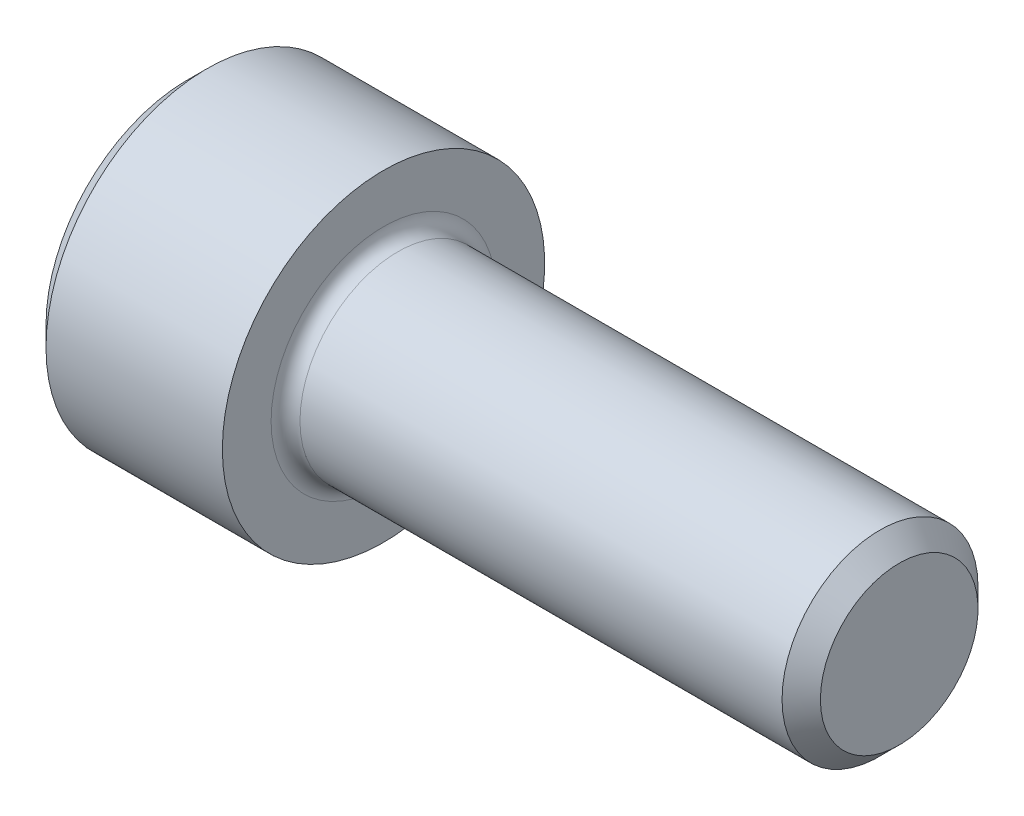
ISO-10303-21;
HEADER;
FILE_DESCRIPTION(('STEP AP214'),'2;1');
FILE_NAME('part.step','',(''),(''),'','','');
FILE_SCHEMA(('AUTOMOTIVE_DESIGN { 1 0 10303 214 1 1 1 1 }'));
ENDSEC;
DATA;
#1=APPLICATION_CONTEXT('core data for automotive mechanical design processes');
#2=APPLICATION_PROTOCOL_DEFINITION('international standard','automotive_design',2000,#1);
#3=PRODUCT_CONTEXT('',#1,'mechanical');
#4=PRODUCT('Part','Part','',(#3));
#5=PRODUCT_RELATED_PRODUCT_CATEGORY('part','',(#4));
#6=PRODUCT_DEFINITION_FORMATION('','',#4);
#7=PRODUCT_DEFINITION_CONTEXT('part definition',#1,'design');
#8=PRODUCT_DEFINITION('design','',#6,#7);
#9=PRODUCT_DEFINITION_SHAPE('','',#8);
#10=(LENGTH_UNIT() NAMED_UNIT(*) SI_UNIT(.MILLI.,.METRE.));
#11=(NAMED_UNIT(*) PLANE_ANGLE_UNIT() SI_UNIT($,.RADIAN.));
#12=(NAMED_UNIT(*) SI_UNIT($,.STERADIAN.) SOLID_ANGLE_UNIT());
#13=UNCERTAINTY_MEASURE_WITH_UNIT(LENGTH_MEASURE(1.E-05),#10,'distance_accuracy_value','');
#14=(GEOMETRIC_REPRESENTATION_CONTEXT(3) GLOBAL_UNCERTAINTY_ASSIGNED_CONTEXT((#13)) GLOBAL_UNIT_ASSIGNED_CONTEXT((#10,
#11,#12)) REPRESENTATION_CONTEXT('',''));
#15=CARTESIAN_POINT('',(0.,0.,0.));
#16=DIRECTION('',(0.,0.,1.));
#17=DIRECTION('',(1.,0.,0.));
#18=AXIS2_PLACEMENT_3D('',#15,#16,#17);
#19=CARTESIAN_POINT('',(2.286,1.14604605784411,1.98501));
#20=DIRECTION('',(-1.,0.,0.));
#21=DIRECTION('',(0.,0.,1.));
#22=AXIS2_PLACEMENT_3D('',#19,#20,#21);
#23=PLANE('',#22);
#24=CARTESIAN_POINT('',(2.286,0.,0.));
#25=DIRECTION('',(-1.,0.,0.));
#26=DIRECTION('',(0.,0.,1.));
#27=AXIS2_PLACEMENT_3D('',#24,#25,#26);
#28=CIRCLE('',#27,1.98501);
#29=CARTESIAN_POINT('',(2.286,0.,1.98501));
#30=VERTEX_POINT('',#29);
#31=CARTESIAN_POINT('',(2.286,1.71906908676615,0.992505));
#32=VERTEX_POINT('',#31);
#33=EDGE_CURVE('E11',#30,#32,#28,.T.);
#34=ORIENTED_EDGE('',*,*,#33,.F.);
#35=DIRECTION('',(0.,1.,0.));
#36=VECTOR('',#35,1.);
#37=CARTESIAN_POINT('',(2.286,-1.14604605784409,1.98501));
#38=LINE('',#37,#36);
#39=CARTESIAN_POINT('',(2.286,1.14604605784411,1.98501));
#40=VERTEX_POINT('',#39);
#41=EDGE_CURVE('E138',#30,#40,#38,.T.);
#42=ORIENTED_EDGE('',*,*,#41,.T.);
#43=DIRECTION('',(0.,-0.5,0.86602540378444));
#44=VECTOR('',#43,1.);
#45=CARTESIAN_POINT('',(2.286,2.29209211568821,0.));
#46=LINE('',#45,#44);
#47=EDGE_CURVE('E141',#32,#40,#46,.T.);
#48=ORIENTED_EDGE('',*,*,#47,.F.);
#49=EDGE_LOOP('',(#34,#42,#48));
#50=FACE_BOUND('',#49,.T.);
#51=ADVANCED_FACE('F17',(#50),#23,.T.);
#52=CARTESIAN_POINT('',(2.286,1.14604605784411,1.98501));
#53=DIRECTION('',(-1.,0.,0.));
#54=DIRECTION('',(0.,0.,1.));
#55=AXIS2_PLACEMENT_3D('',#52,#53,#54);
#56=PLANE('',#55);
#57=CARTESIAN_POINT('',(2.286,0.,0.));
#58=DIRECTION('',(-1.,0.,0.));
#59=DIRECTION('',(0.,0.,1.));
#60=AXIS2_PLACEMENT_3D('',#57,#58,#59);
#61=CIRCLE('',#60,1.98501);
#62=CARTESIAN_POINT('',(2.286,1.71906908676615,-0.992505));
#63=VERTEX_POINT('',#62);
#64=EDGE_CURVE('E25',#32,#63,#61,.T.);
#65=ORIENTED_EDGE('',*,*,#64,.F.);
#66=DIRECTION('',(0.,-0.5,0.86602540378444));
#67=VECTOR('',#66,1.);
#68=CARTESIAN_POINT('',(2.286,2.29209211568821,0.));
#69=LINE('',#68,#67);
#70=CARTESIAN_POINT('',(2.286,2.29209211568821,0.));
#71=VERTEX_POINT('',#70);
#72=EDGE_CURVE('E226',#71,#32,#69,.T.);
#73=ORIENTED_EDGE('',*,*,#72,.F.);
#74=DIRECTION('',(0.,-0.5,-0.866025403784438));
#75=VECTOR('',#74,1.);
#76=CARTESIAN_POINT('',(2.286,2.29209211568821,0.));
#77=LINE('',#76,#75);
#78=EDGE_CURVE('E263',#71,#63,#77,.T.);
#79=ORIENTED_EDGE('',*,*,#78,.T.);
#80=EDGE_LOOP('',(#65,#73,#79));
#81=FACE_BOUND('',#80,.T.);
#82=ADVANCED_FACE('F129',(#81),#56,.T.);
#83=CARTESIAN_POINT('',(2.286,1.14604605784411,1.98501));
#84=DIRECTION('',(-1.,0.,0.));
#85=DIRECTION('',(0.,0.,1.));
#86=AXIS2_PLACEMENT_3D('',#83,#84,#85);
#87=PLANE('',#86);
#88=CARTESIAN_POINT('',(2.286,0.,0.));
#89=DIRECTION('',(-1.,0.,0.));
#90=DIRECTION('',(0.,0.,1.));
#91=AXIS2_PLACEMENT_3D('',#88,#89,#90);
#92=CIRCLE('',#91,1.98501);
#93=CARTESIAN_POINT('',(2.286,0.,-1.98501));
#94=VERTEX_POINT('',#93);
#95=EDGE_CURVE('E270',#63,#94,#92,.T.);
#96=ORIENTED_EDGE('',*,*,#95,.F.);
#97=DIRECTION('',(0.,-0.5,-0.866025403784438));
#98=VECTOR('',#97,1.);
#99=CARTESIAN_POINT('',(2.286,2.29209211568821,0.));
#100=LINE('',#99,#98);
#101=CARTESIAN_POINT('',(2.286,1.1460460578441,-1.98501));
#102=VERTEX_POINT('',#101);
#103=EDGE_CURVE('E46',#63,#102,#100,.T.);
#104=ORIENTED_EDGE('',*,*,#103,.T.);
#105=DIRECTION('',(0.,-1.,0.));
#106=VECTOR('',#105,1.);
#107=CARTESIAN_POINT('',(2.286,1.1460460578441,-1.98501));
#108=LINE('',#107,#106);
#109=EDGE_CURVE('E254',#102,#94,#108,.T.);
#110=ORIENTED_EDGE('',*,*,#109,.T.);
#111=EDGE_LOOP('',(#96,#104,#110));
#112=FACE_BOUND('',#111,.T.);
#113=ADVANCED_FACE('F134',(#112),#87,.T.);
#114=CARTESIAN_POINT('',(2.286,1.14604605784411,1.98501));
#115=DIRECTION('',(-1.,0.,0.));
#116=DIRECTION('',(0.,0.,1.));
#117=AXIS2_PLACEMENT_3D('',#114,#115,#116);
#118=PLANE('',#117);
#119=CARTESIAN_POINT('',(2.286,0.,0.));
#120=DIRECTION('',(-1.,0.,0.));
#121=DIRECTION('',(0.,0.,1.));
#122=AXIS2_PLACEMENT_3D('',#119,#120,#121);
#123=CIRCLE('',#122,1.98501);
#124=CARTESIAN_POINT('',(2.286,-1.71906908676615,-0.992505));
#125=VERTEX_POINT('',#124);
#126=EDGE_CURVE('E177',#94,#125,#123,.T.);
#127=ORIENTED_EDGE('',*,*,#126,.F.);
#128=DIRECTION('',(0.,-1.,0.));
#129=VECTOR('',#128,1.);
#130=CARTESIAN_POINT('',(2.286,1.1460460578441,-1.98501));
#131=LINE('',#130,#129);
#132=CARTESIAN_POINT('',(2.286,-1.1460460578441,-1.98501));
#133=VERTEX_POINT('',#132);
#134=EDGE_CURVE('E241',#94,#133,#131,.T.);
#135=ORIENTED_EDGE('',*,*,#134,.T.);
#136=DIRECTION('',(0.,0.5,-0.86602540378444));
#137=VECTOR('',#136,1.);
#138=CARTESIAN_POINT('',(2.286,-2.2920921156882,0.));
#139=LINE('',#138,#137);
#140=EDGE_CURVE('E245',#125,#133,#139,.T.);
#141=ORIENTED_EDGE('',*,*,#140,.F.);
#142=EDGE_LOOP('',(#127,#135,#141));
#143=FACE_BOUND('',#142,.T.);
#144=ADVANCED_FACE('F616',(#143),#118,.T.);
#145=CARTESIAN_POINT('',(2.286,1.14604605784411,1.98501));
#146=DIRECTION('',(-1.,0.,0.));
#147=DIRECTION('',(0.,0.,1.));
#148=AXIS2_PLACEMENT_3D('',#145,#146,#147);
#149=PLANE('',#148);
#150=CARTESIAN_POINT('',(2.286,0.,0.));
#151=DIRECTION('',(-1.,0.,0.));
#152=DIRECTION('',(0.,0.,1.));
#153=AXIS2_PLACEMENT_3D('',#150,#151,#152);
#154=CIRCLE('',#153,1.98501);
#155=CARTESIAN_POINT('',(2.286,-1.71906908676614,0.992505));
#156=VERTEX_POINT('',#155);
#157=EDGE_CURVE('E167',#125,#156,#154,.T.);
#158=ORIENTED_EDGE('',*,*,#157,.F.);
#159=DIRECTION('',(0.,0.5,-0.86602540378444));
#160=VECTOR('',#159,1.);
#161=CARTESIAN_POINT('',(2.286,-2.2920921156882,0.));
#162=LINE('',#161,#160);
#163=CARTESIAN_POINT('',(2.286,-2.2920921156882,0.));
#164=VERTEX_POINT('',#163);
#165=EDGE_CURVE('E233',#164,#125,#162,.T.);
#166=ORIENTED_EDGE('',*,*,#165,.F.);
#167=DIRECTION('',(0.,-0.5,-0.866025403784438));
#168=VECTOR('',#167,1.);
#169=CARTESIAN_POINT('',(2.286,-1.14604605784409,1.98501));
#170=LINE('',#169,#168);
#171=EDGE_CURVE('E184',#156,#164,#170,.T.);
#172=ORIENTED_EDGE('',*,*,#171,.F.);
#173=EDGE_LOOP('',(#158,#166,#172));
#174=FACE_BOUND('',#173,.T.);
#175=ADVANCED_FACE('F609',(#174),#149,.T.);
#176=CARTESIAN_POINT('',(2.286,1.14604605784411,1.98501));
#177=DIRECTION('',(-1.,0.,0.));
#178=DIRECTION('',(0.,0.,1.));
#179=AXIS2_PLACEMENT_3D('',#176,#177,#178);
#180=PLANE('',#179);
#181=CARTESIAN_POINT('',(2.286,0.,0.));
#182=DIRECTION('',(-1.,0.,0.));
#183=DIRECTION('',(0.,0.,1.));
#184=AXIS2_PLACEMENT_3D('',#181,#182,#183);
#185=CIRCLE('',#184,1.98501);
#186=EDGE_CURVE('E147',#156,#30,#185,.T.);
#187=ORIENTED_EDGE('',*,*,#186,.F.);
#188=DIRECTION('',(0.,-0.5,-0.866025403784438));
#189=VECTOR('',#188,1.);
#190=CARTESIAN_POINT('',(2.286,-1.14604605784409,1.98501));
#191=LINE('',#190,#189);
#192=CARTESIAN_POINT('',(2.286,-1.14604605784409,1.98501));
#193=VERTEX_POINT('',#192);
#194=EDGE_CURVE('E153',#193,#156,#191,.T.);
#195=ORIENTED_EDGE('',*,*,#194,.F.);
#196=DIRECTION('',(0.,1.,0.));
#197=VECTOR('',#196,1.);
#198=CARTESIAN_POINT('',(2.286,-1.14604605784409,1.98501));
#199=LINE('',#198,#197);
#200=EDGE_CURVE('E146',#193,#30,#199,.T.);
#201=ORIENTED_EDGE('',*,*,#200,.T.);
#202=EDGE_LOOP('',(#187,#195,#201));
#203=FACE_BOUND('',#202,.T.);
#204=ADVANCED_FACE('F149',(#203),#180,.T.);
#205=CARTESIAN_POINT('',(2.286,2.29209211568821,0.));
#206=DIRECTION('',(0.,0.866025403784438,-0.5));
#207=DIRECTION('',(-1.,0.,0.));
#208=AXIS2_PLACEMENT_3D('',#205,#206,#207);
#209=PLANE('',#208);
#210=DIRECTION('',(0.,-0.5,-0.866025403784438));
#211=VECTOR('',#210,1.);
#212=CARTESIAN_POINT('',(0.,2.29209211568821,0.));
#213=LINE('',#212,#211);
#214=CARTESIAN_POINT('',(0.,2.29209211568821,0.));
#215=VERTEX_POINT('',#214);
#216=CARTESIAN_POINT('',(0.,1.1460460578441,-1.98501));
#217=VERTEX_POINT('',#216);
#218=EDGE_CURVE('E225',#215,#217,#213,.T.);
#219=ORIENTED_EDGE('',*,*,#218,.T.);
#220=DIRECTION('',(-1.,0.,0.));
#221=VECTOR('',#220,1.);
#222=CARTESIAN_POINT('',(2.286,1.1460460578441,-1.98501));
#223=LINE('',#222,#221);
#224=EDGE_CURVE('E256',#102,#217,#223,.T.);
#225=ORIENTED_EDGE('',*,*,#224,.F.);
#226=ORIENTED_EDGE('',*,*,#103,.F.);
#227=ORIENTED_EDGE('',*,*,#78,.F.);
#228=DIRECTION('',(-1.,0.,0.));
#229=VECTOR('',#228,1.);
#230=CARTESIAN_POINT('',(2.286,2.29209211568821,0.));
#231=LINE('',#230,#229);
#232=EDGE_CURVE('E224',#71,#215,#231,.T.);
#233=ORIENTED_EDGE('',*,*,#232,.T.);
#234=EDGE_LOOP('',(#219,#225,#226,#227,#233));
#235=FACE_BOUND('',#234,.T.);
#236=ADVANCED_FACE('F591',(#235),#209,.F.);
#237=CARTESIAN_POINT('',(2.286,1.1460460578441,-1.98501));
#238=DIRECTION('',(0.,0.,-1.));
#239=DIRECTION('',(0.,-1.,0.));
#240=AXIS2_PLACEMENT_3D('',#237,#238,#239);
#241=PLANE('',#240);
#242=DIRECTION('',(0.,-1.,0.));
#243=VECTOR('',#242,1.);
#244=CARTESIAN_POINT('',(0.,1.1460460578441,-1.98501));
#245=LINE('',#244,#243);
#246=CARTESIAN_POINT('',(0.,-1.1460460578441,-1.98501));
#247=VERTEX_POINT('',#246);
#248=EDGE_CURVE('E200',#217,#247,#245,.T.);
#249=ORIENTED_EDGE('',*,*,#248,.T.);
#250=DIRECTION('',(-1.,0.,0.));
#251=VECTOR('',#250,1.);
#252=CARTESIAN_POINT('',(2.286,-1.1460460578441,-1.98501));
#253=LINE('',#252,#251);
#254=EDGE_CURVE('E238',#133,#247,#253,.T.);
#255=ORIENTED_EDGE('',*,*,#254,.F.);
#256=ORIENTED_EDGE('',*,*,#134,.F.);
#257=ORIENTED_EDGE('',*,*,#109,.F.);
#258=ORIENTED_EDGE('',*,*,#224,.T.);
#259=EDGE_LOOP('',(#249,#255,#256,#257,#258));
#260=FACE_BOUND('',#259,.T.);
#261=ADVANCED_FACE('F582',(#260),#241,.F.);
#262=CARTESIAN_POINT('',(2.286,-2.2920921156882,0.));
#263=DIRECTION('',(0.,0.866025403784439,0.5));
#264=DIRECTION('',(1.,0.,0.));
#265=AXIS2_PLACEMENT_3D('',#262,#263,#264);
#266=PLANE('',#265);
#267=DIRECTION('',(0.,0.5,-0.86602540378444));
#268=VECTOR('',#267,1.);
#269=CARTESIAN_POINT('',(0.,-2.2920921156882,0.));
#270=LINE('',#269,#268);
#271=CARTESIAN_POINT('',(0.,-2.2920921156882,0.));
#272=VERTEX_POINT('',#271);
#273=EDGE_CURVE('E193',#272,#247,#270,.T.);
#274=ORIENTED_EDGE('',*,*,#273,.F.);
#275=DIRECTION('',(-1.,0.,0.));
#276=VECTOR('',#275,1.);
#277=CARTESIAN_POINT('',(2.286,-2.2920921156882,0.));
#278=LINE('',#277,#276);
#279=EDGE_CURVE('E230',#164,#272,#278,.T.);
#280=ORIENTED_EDGE('',*,*,#279,.F.);
#281=ORIENTED_EDGE('',*,*,#165,.T.);
#282=ORIENTED_EDGE('',*,*,#140,.T.);
#283=ORIENTED_EDGE('',*,*,#254,.T.);
#284=EDGE_LOOP('',(#274,#280,#281,#282,#283));
#285=FACE_BOUND('',#284,.T.);
#286=ADVANCED_FACE('F572',(#285),#266,.T.);
#287=CARTESIAN_POINT('',(2.286,-1.14604605784409,1.98501));
#288=DIRECTION('',(0.,0.866025403784438,-0.5));
#289=DIRECTION('',(-1.,0.,0.));
#290=AXIS2_PLACEMENT_3D('',#287,#288,#289);
#291=PLANE('',#290);
#292=DIRECTION('',(0.,-0.5,-0.866025403784438));
#293=VECTOR('',#292,1.);
#294=CARTESIAN_POINT('',(0.,-1.14604605784409,1.98501));
#295=LINE('',#294,#293);
#296=CARTESIAN_POINT('',(0.,-1.14604605784409,1.98501));
#297=VERTEX_POINT('',#296);
#298=EDGE_CURVE('E188',#297,#272,#295,.T.);
#299=ORIENTED_EDGE('',*,*,#298,.F.);
#300=DIRECTION('',(-1.,0.,0.));
#301=VECTOR('',#300,1.);
#302=CARTESIAN_POINT('',(2.286,-1.14604605784409,1.98501));
#303=LINE('',#302,#301);
#304=EDGE_CURVE('E160',#193,#297,#303,.T.);
#305=ORIENTED_EDGE('',*,*,#304,.F.);
#306=ORIENTED_EDGE('',*,*,#194,.T.);
#307=ORIENTED_EDGE('',*,*,#171,.T.);
#308=ORIENTED_EDGE('',*,*,#279,.T.);
#309=EDGE_LOOP('',(#299,#305,#306,#307,#308));
#310=FACE_BOUND('',#309,.T.);
#311=ADVANCED_FACE('F564',(#310),#291,.T.);
#312=CARTESIAN_POINT('',(2.286,-1.14604605784409,1.98501));
#313=DIRECTION('',(0.,0.,1.));
#314=DIRECTION('',(0.,-1.,0.));
#315=AXIS2_PLACEMENT_3D('',#312,#313,#314);
#316=PLANE('',#315);
#317=DIRECTION('',(0.,1.,0.));
#318=VECTOR('',#317,1.);
#319=CARTESIAN_POINT('',(0.,-1.14604605784409,1.98501));
#320=LINE('',#319,#318);
#321=CARTESIAN_POINT('',(0.,1.14604605784411,1.98501));
#322=VERTEX_POINT('',#321);
#323=EDGE_CURVE('E186',#297,#322,#320,.T.);
#324=ORIENTED_EDGE('',*,*,#323,.T.);
#325=DIRECTION('',(-1.,0.,0.));
#326=VECTOR('',#325,1.);
#327=CARTESIAN_POINT('',(2.286,1.14604605784411,1.98501));
#328=LINE('',#327,#326);
#329=EDGE_CURVE('E161',#40,#322,#328,.T.);
#330=ORIENTED_EDGE('',*,*,#329,.F.);
#331=ORIENTED_EDGE('',*,*,#41,.F.);
#332=ORIENTED_EDGE('',*,*,#200,.F.);
#333=ORIENTED_EDGE('',*,*,#304,.T.);
#334=EDGE_LOOP('',(#324,#330,#331,#332,#333));
#335=FACE_BOUND('',#334,.T.);
#336=ADVANCED_FACE('F159',(#335),#316,.F.);
#337=CARTESIAN_POINT('',(2.286,2.29209211568821,0.));
#338=DIRECTION('',(0.,-0.86602540378444,-0.5));
#339=DIRECTION('',(0.,0.5,-0.86602540378444));
#340=AXIS2_PLACEMENT_3D('',#337,#338,#339);
#341=PLANE('',#340);
#342=DIRECTION('',(0.,-0.5,0.86602540378444));
#343=VECTOR('',#342,1.);
#344=CARTESIAN_POINT('',(0.,2.29209211568821,0.));
#345=LINE('',#344,#343);
#346=EDGE_CURVE('E189',#215,#322,#345,.T.);
#347=ORIENTED_EDGE('',*,*,#346,.F.);
#348=ORIENTED_EDGE('',*,*,#232,.F.);
#349=ORIENTED_EDGE('',*,*,#72,.T.);
#350=ORIENTED_EDGE('',*,*,#47,.T.);
#351=ORIENTED_EDGE('',*,*,#329,.T.);
#352=EDGE_LOOP('',(#347,#348,#349,#350,#351));
#353=FACE_BOUND('',#352,.T.);
#354=ADVANCED_FACE('F547',(#353),#341,.T.);
#355=CARTESIAN_POINT('',(17.526,1.94056,0.));
#356=DIRECTION('',(1.,0.,0.));
#357=DIRECTION('',(0.,1.,0.));
#358=AXIS2_PLACEMENT_3D('',#355,#356,#357);
#359=PLANE('',#358);
#360=CARTESIAN_POINT('',(17.526,0.,0.));
#361=DIRECTION('',(-1.,0.,0.));
#362=DIRECTION('',(0.,0.,1.));
#363=AXIS2_PLACEMENT_3D('',#360,#361,#362);
#364=CIRCLE('',#363,1.94056);
#365=CARTESIAN_POINT('',(17.526,0.,1.94056));
#366=VERTEX_POINT('',#365);
#367=EDGE_CURVE('E191',#366,#366,#364,.T.);
#368=ORIENTED_EDGE('',*,*,#367,.F.);
#369=EDGE_LOOP('',(#368));
#370=FACE_BOUND('',#369,.T.);
#371=ADVANCED_FACE('F495',(#370),#359,.T.);
#372=CARTESIAN_POINT('',(4.826,3.96875,0.));
#373=DIRECTION('',(1.,0.,0.));
#374=DIRECTION('',(0.,1.,0.));
#375=AXIS2_PLACEMENT_3D('',#372,#373,#374);
#376=PLANE('',#375);
#377=CARTESIAN_POINT('',(4.826,0.,0.));
#378=DIRECTION('',(-1.,0.,0.));
#379=DIRECTION('',(0.,0.,-1.));
#380=AXIS2_PLACEMENT_3D('',#377,#378,#379);
#381=CIRCLE('',#380,2.7686);
#382=CARTESIAN_POINT('',(4.826,0.,-2.7686));
#383=VERTEX_POINT('',#382);
#384=EDGE_CURVE('E180',#383,#383,#381,.T.);
#385=ORIENTED_EDGE('',*,*,#384,.T.);
#386=EDGE_LOOP('',(#385));
#387=FACE_BOUND('',#386,.T.);
#388=CARTESIAN_POINT('',(4.826,0.,0.));
#389=DIRECTION('',(-1.,0.,0.));
#390=DIRECTION('',(0.,0.,1.));
#391=AXIS2_PLACEMENT_3D('',#388,#389,#390);
#392=CIRCLE('',#391,3.96875);
#393=CARTESIAN_POINT('',(4.826,0.,3.96875));
#394=VERTEX_POINT('',#393);
#395=EDGE_CURVE('E199',#394,#394,#392,.T.);
#396=ORIENTED_EDGE('',*,*,#395,.F.);
#397=EDGE_LOOP('',(#396));
#398=FACE_BOUND('',#397,.T.);
#399=ADVANCED_FACE('F490',(#387,#398),#376,.T.);
#400=CARTESIAN_POINT('',(0.,0.,0.));
#401=DIRECTION('',(-1.,0.,0.));
#402=DIRECTION('',(0.,0.,1.));
#403=AXIS2_PLACEMENT_3D('',#400,#401,#402);
#404=PLANE('',#403);
#405=ORIENTED_EDGE('',*,*,#346,.T.);
#406=ORIENTED_EDGE('',*,*,#323,.F.);
#407=ORIENTED_EDGE('',*,*,#298,.T.);
#408=ORIENTED_EDGE('',*,*,#273,.T.);
#409=ORIENTED_EDGE('',*,*,#248,.F.);
#410=ORIENTED_EDGE('',*,*,#218,.F.);
#411=EDGE_LOOP('',(#405,#406,#407,#408,#409,#410));
#412=FACE_BOUND('',#411,.T.);
#413=CARTESIAN_POINT('',(0.,0.,0.));
#414=DIRECTION('',(-1.,0.,0.));
#415=DIRECTION('',(0.,0.,1.));
#416=AXIS2_PLACEMENT_3D('',#413,#414,#415);
#417=CIRCLE('',#416,3.48615);
#418=CARTESIAN_POINT('',(0.,0.,3.48615));
#419=VERTEX_POINT('',#418);
#420=EDGE_CURVE('E207',#419,#419,#417,.T.);
#421=ORIENTED_EDGE('',*,*,#420,.T.);
#422=EDGE_LOOP('',(#421));
#423=FACE_BOUND('',#422,.T.);
#424=ADVANCED_FACE('F491',(#412,#423),#404,.T.);
#425=CARTESIAN_POINT('',(0.,0.,0.));
#426=DIRECTION('',(1.,0.,0.));
#427=DIRECTION('',(0.,0.,-1.));
#428=AXIS2_PLACEMENT_3D('',#425,#426,#427);
#429=CONICAL_SURFACE('',#428,3.48615,0.78539816339745);
#430=CARTESIAN_POINT('',(0.4826,0.,0.));
#431=DIRECTION('',(-1.,0.,0.));
#432=DIRECTION('',(0.,0.,1.));
#433=AXIS2_PLACEMENT_3D('',#430,#431,#432);
#434=CIRCLE('',#433,3.96875);
#435=CARTESIAN_POINT('',(0.4826,0.,3.96875));
#436=VERTEX_POINT('',#435);
#437=EDGE_CURVE('E204',#436,#436,#434,.T.);
#438=ORIENTED_EDGE('',*,*,#437,.T.);
#439=EDGE_LOOP('',(#438));
#440=FACE_BOUND('',#439,.T.);
#441=ORIENTED_EDGE('',*,*,#420,.F.);
#442=EDGE_LOOP('',(#441));
#443=FACE_BOUND('',#442,.T.);
#444=ADVANCED_FACE('F512',(#440,#443),#429,.T.);
#445=CARTESIAN_POINT('',(-31.75,0.,0.));
#446=DIRECTION('',(-1.,0.,0.));
#447=DIRECTION('',(0.,0.,1.));
#448=AXIS2_PLACEMENT_3D('',#445,#446,#447);
#449=CYLINDRICAL_SURFACE('',#448,3.96875);
#450=ORIENTED_EDGE('',*,*,#437,.F.);
#451=EDGE_LOOP('',(#450));
#452=FACE_BOUND('',#451,.T.);
#453=ORIENTED_EDGE('',*,*,#395,.T.);
#454=EDGE_LOOP('',(#453));
#455=FACE_BOUND('',#454,.T.);
#456=ADVANCED_FACE('F524',(#452,#455),#449,.T.);
#457=CARTESIAN_POINT('',(-31.75,0.,0.));
#458=DIRECTION('',(-1.,0.,0.));
#459=DIRECTION('',(0.,0.,1.));
#460=AXIS2_PLACEMENT_3D('',#457,#458,#459);
#461=CYLINDRICAL_SURFACE('',#460,2.413);
#462=CARTESIAN_POINT('',(5.1816,0.,0.));
#463=DIRECTION('',(1.,0.,0.));
#464=DIRECTION('',(0.,0.,-1.));
#465=AXIS2_PLACEMENT_3D('',#462,#463,#464);
#466=CIRCLE('',#465,2.413);
#467=CARTESIAN_POINT('',(5.1816,0.,-2.413));
#468=VERTEX_POINT('',#467);
#469=EDGE_CURVE('E169',#468,#468,#466,.T.);
#470=ORIENTED_EDGE('',*,*,#469,.T.);
#471=EDGE_LOOP('',(#470));
#472=FACE_BOUND('',#471,.T.);
#473=CARTESIAN_POINT('',(17.05356,0.,0.));
#474=DIRECTION('',(-1.,0.,0.));
#475=DIRECTION('',(0.,0.,1.));
#476=AXIS2_PLACEMENT_3D('',#473,#474,#475);
#477=CIRCLE('',#476,2.41299999999997);
#478=CARTESIAN_POINT('',(17.05356,0.,2.41299999999997));
#479=VERTEX_POINT('',#478);
#480=EDGE_CURVE('E202',#479,#479,#477,.T.);
#481=ORIENTED_EDGE('',*,*,#480,.T.);
#482=EDGE_LOOP('',(#481));
#483=FACE_BOUND('',#482,.T.);
#484=ADVANCED_FACE('F505',(#472,#483),#461,.T.);
#485=CARTESIAN_POINT('',(17.526,0.,0.));
#486=DIRECTION('',(-1.,0.,0.));
#487=DIRECTION('',(0.,0.,1.));
#488=AXIS2_PLACEMENT_3D('',#485,#486,#487);
#489=CONICAL_SURFACE('',#488,1.94056,0.785398163397401);
#490=ORIENTED_EDGE('',*,*,#480,.F.);
#491=EDGE_LOOP('',(#490));
#492=FACE_BOUND('',#491,.T.);
#493=ORIENTED_EDGE('',*,*,#367,.T.);
#494=EDGE_LOOP('',(#493));
#495=FACE_BOUND('',#494,.T.);
#496=ADVANCED_FACE('F122',(#492,#495),#489,.T.);
#497=CARTESIAN_POINT('',(5.1816,0.,0.));
#498=DIRECTION('',(1.,0.,0.));
#499=DIRECTION('',(0.,0.,-1.));
#500=AXIS2_PLACEMENT_3D('',#497,#498,#499);
#501=TOROIDAL_SURFACE('',#500,2.7686,0.3556);
#502=ORIENTED_EDGE('',*,*,#384,.F.);
#503=EDGE_LOOP('',(#502));
#504=FACE_BOUND('',#503,.T.);
#505=ORIENTED_EDGE('',*,*,#469,.F.);
#506=EDGE_LOOP('',(#505));
#507=FACE_BOUND('',#506,.T.);
#508=ADVANCED_FACE('F119',(#504,#507),#501,.F.);
#509=CARTESIAN_POINT('',(2.286,0.,0.));
#510=DIRECTION('',(-1.,0.,0.));
#511=DIRECTION('',(0.,0.,1.));
#512=AXIS2_PLACEMENT_3D('',#509,#510,#511);
#513=CONICAL_SURFACE('',#512,1.98501,1.0471975511966);
#514=ORIENTED_EDGE('',*,*,#186,.T.);
#515=ORIENTED_EDGE('',*,*,#33,.T.);
#516=ORIENTED_EDGE('',*,*,#64,.T.);
#517=ORIENTED_EDGE('',*,*,#95,.T.);
#518=ORIENTED_EDGE('',*,*,#126,.T.);
#519=ORIENTED_EDGE('',*,*,#157,.T.);
#520=EDGE_LOOP('',(#514,#515,#516,#517,#518,#519));
#521=FACE_BOUND('',#520,.T.);
#522=CARTESIAN_POINT('',(3.43204605784411,0.,0.));
#523=VERTEX_POINT('',#522);
#524=VERTEX_LOOP('',#523);
#525=FACE_BOUND('',#524,.T.);
#526=ADVANCED_FACE('F116',(#521,#525),#513,.F.);
#527=CLOSED_SHELL('',(#51,#82,#113,#144,#175,#204,#236,#261,#286,#311,#336,#354,#371,#399,#424,
#444,#456,#484,#496,#508,#526));
#528=MANIFOLD_SOLID_BREP('B1',#527);
#529=ADVANCED_BREP_SHAPE_REPRESENTATION('',(#18,#528),#14);
#530=SHAPE_DEFINITION_REPRESENTATION(#9,#529);
ENDSEC;
END-ISO-10303-21;
